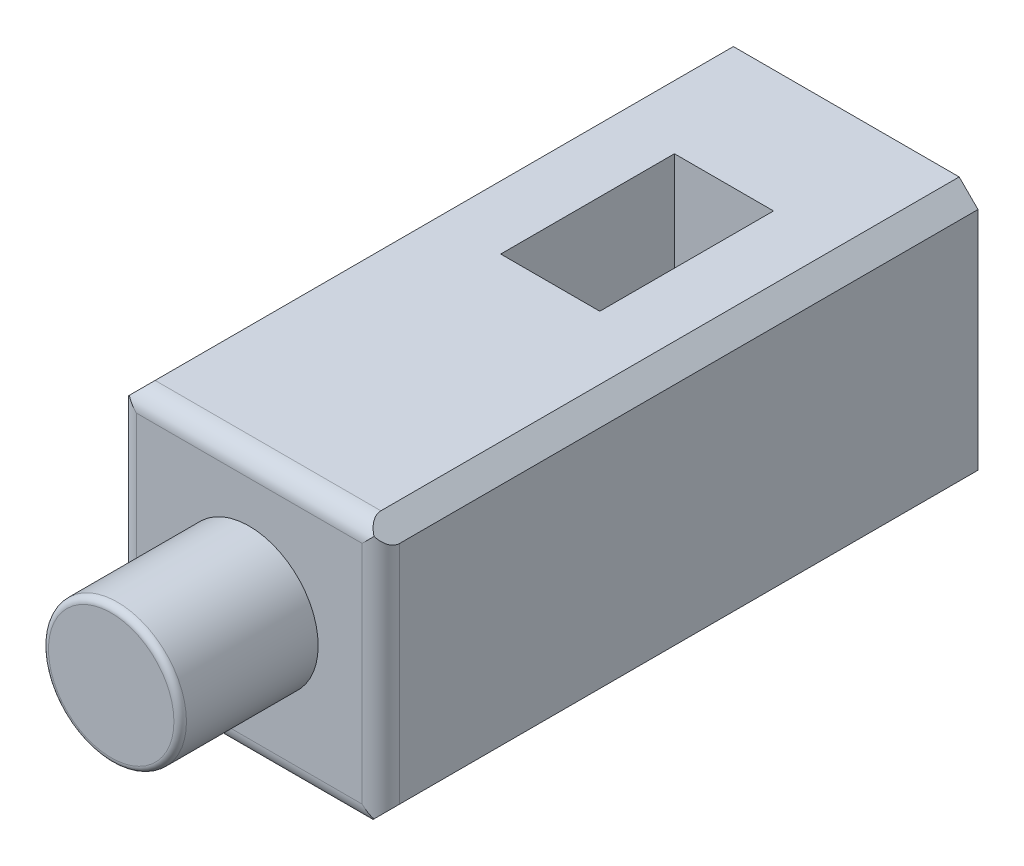
ISO-10303-21;
HEADER;
FILE_DESCRIPTION(('STEP AP214'),'2;1');
FILE_NAME('part.step','',(''),(''),'','','');
FILE_SCHEMA(('AUTOMOTIVE_DESIGN { 1 0 10303 214 1 1 1 1 }'));
ENDSEC;
DATA;
#1=APPLICATION_CONTEXT('core data for automotive mechanical design processes');
#2=APPLICATION_PROTOCOL_DEFINITION('international standard','automotive_design',2000,#1);
#3=PRODUCT_CONTEXT('',#1,'mechanical');
#4=PRODUCT('Part','Part','',(#3));
#5=PRODUCT_RELATED_PRODUCT_CATEGORY('part','',(#4));
#6=PRODUCT_DEFINITION_FORMATION('','',#4);
#7=PRODUCT_DEFINITION_CONTEXT('part definition',#1,'design');
#8=PRODUCT_DEFINITION('design','',#6,#7);
#9=PRODUCT_DEFINITION_SHAPE('','',#8);
#10=(LENGTH_UNIT() NAMED_UNIT(*) SI_UNIT(.MILLI.,.METRE.));
#11=(NAMED_UNIT(*) PLANE_ANGLE_UNIT() SI_UNIT($,.RADIAN.));
#12=(NAMED_UNIT(*) SI_UNIT($,.STERADIAN.) SOLID_ANGLE_UNIT());
#13=UNCERTAINTY_MEASURE_WITH_UNIT(LENGTH_MEASURE(1.E-05),#10,'distance_accuracy_value','');
#14=(GEOMETRIC_REPRESENTATION_CONTEXT(3) GLOBAL_UNCERTAINTY_ASSIGNED_CONTEXT((#13)) GLOBAL_UNIT_ASSIGNED_CONTEXT((#10,
#11,#12)) REPRESENTATION_CONTEXT('',''));
#15=CARTESIAN_POINT('',(0.,0.,0.));
#16=DIRECTION('',(0.,0.,1.));
#17=DIRECTION('',(1.,0.,0.));
#18=AXIS2_PLACEMENT_3D('',#15,#16,#17);
#19=CARTESIAN_POINT('',(21.,-21.,95.2));
#20=DIRECTION('',(-1.,0.,0.));
#21=DIRECTION('',(0.,0.,1.));
#22=AXIS2_PLACEMENT_3D('',#19,#20,#21);
#23=PLANE('',#22);
#24=DIRECTION('',(0.,0.,1.));
#25=VECTOR('',#24,1.);
#26=CARTESIAN_POINT('',(21.,18.,95.2));
#27=LINE('',#26,#25);
#28=CARTESIAN_POINT('',(21.,18.,0.));
#29=VERTEX_POINT('',#28);
#30=CARTESIAN_POINT('',(21.,18.,92.2));
#31=VERTEX_POINT('',#30);
#32=EDGE_CURVE('E233',#29,#31,#27,.T.);
#33=ORIENTED_EDGE('',*,*,#32,.T.);
#34=DIRECTION('',(0.,1.,0.));
#35=VECTOR('',#34,1.);
#36=CARTESIAN_POINT('',(21.,-21.,92.2));
#37=LINE('',#36,#35);
#38=CARTESIAN_POINT('',(21.,-18.,92.2));
#39=VERTEX_POINT('',#38);
#40=EDGE_CURVE('E267',#31,#39,#37,.F.);
#41=ORIENTED_EDGE('',*,*,#40,.T.);
#42=DIRECTION('',(0.,0.,-1.));
#43=VECTOR('',#42,1.);
#44=CARTESIAN_POINT('',(21.,-18.,95.2));
#45=LINE('',#44,#43);
#46=CARTESIAN_POINT('',(21.,-18.,0.));
#47=VERTEX_POINT('',#46);
#48=EDGE_CURVE('E236',#39,#47,#45,.T.);
#49=ORIENTED_EDGE('',*,*,#48,.T.);
#50=DIRECTION('',(0.,1.,0.));
#51=VECTOR('',#50,1.);
#52=CARTESIAN_POINT('',(21.,-21.,0.));
#53=LINE('',#52,#51);
#54=EDGE_CURVE('E193',#47,#29,#53,.T.);
#55=ORIENTED_EDGE('',*,*,#54,.T.);
#56=EDGE_LOOP('',(#33,#41,#49,#55));
#57=FACE_BOUND('',#56,.T.);
#58=ADVANCED_FACE('F36',(#57),#23,.F.);
#59=CARTESIAN_POINT('',(-21.,21.,95.2));
#60=DIRECTION('',(0.,-1.,0.));
#61=DIRECTION('',(0.,0.,-1.));
#62=AXIS2_PLACEMENT_3D('',#59,#60,#61);
#63=PLANE('',#62);
#64=DIRECTION('',(-1.,0.,0.));
#65=VECTOR('',#64,1.);
#66=CARTESIAN_POINT('',(-7.9,21.,19.5));
#67=LINE('',#66,#65);
#68=CARTESIAN_POINT('',(7.9,21.,19.5));
#69=VERTEX_POINT('',#68);
#70=CARTESIAN_POINT('',(-7.9,21.,19.5));
#71=VERTEX_POINT('',#70);
#72=EDGE_CURVE('E186',#69,#71,#67,.T.);
#73=ORIENTED_EDGE('',*,*,#72,.F.);
#74=DIRECTION('',(0.,0.,-1.));
#75=VECTOR('',#74,1.);
#76=CARTESIAN_POINT('',(7.9,21.,47.2));
#77=LINE('',#76,#75);
#78=CARTESIAN_POINT('',(7.9,21.,47.2));
#79=VERTEX_POINT('',#78);
#80=EDGE_CURVE('E157',#79,#69,#77,.T.);
#81=ORIENTED_EDGE('',*,*,#80,.F.);
#82=DIRECTION('',(1.,0.,0.));
#83=VECTOR('',#82,1.);
#84=CARTESIAN_POINT('',(-7.9,21.,47.2));
#85=LINE('',#84,#83);
#86=CARTESIAN_POINT('',(-7.9,21.,47.2));
#87=VERTEX_POINT('',#86);
#88=EDGE_CURVE('E174',#87,#79,#85,.T.);
#89=ORIENTED_EDGE('',*,*,#88,.F.);
#90=DIRECTION('',(0.,0.,1.));
#91=VECTOR('',#90,1.);
#92=CARTESIAN_POINT('',(-7.9,21.,47.2));
#93=LINE('',#92,#91);
#94=EDGE_CURVE('E177',#71,#87,#93,.T.);
#95=ORIENTED_EDGE('',*,*,#94,.F.);
#96=EDGE_LOOP('',(#73,#81,#89,#95));
#97=FACE_BOUND('',#96,.T.);
#98=DIRECTION('',(0.,0.,1.));
#99=VECTOR('',#98,1.);
#100=CARTESIAN_POINT('',(-18.,21.,95.2));
#101=LINE('',#100,#99);
#102=CARTESIAN_POINT('',(-18.,21.,0.));
#103=VERTEX_POINT('',#102);
#104=CARTESIAN_POINT('',(-18.,21.,92.2));
#105=VERTEX_POINT('',#104);
#106=EDGE_CURVE('E231',#103,#105,#101,.T.);
#107=ORIENTED_EDGE('',*,*,#106,.T.);
#108=DIRECTION('',(-1.,0.,0.));
#109=VECTOR('',#108,1.);
#110=CARTESIAN_POINT('',(-21.,21.,92.2));
#111=LINE('',#110,#109);
#112=CARTESIAN_POINT('',(18.,21.,92.2));
#113=VERTEX_POINT('',#112);
#114=EDGE_CURVE('E59',#105,#113,#111,.F.);
#115=ORIENTED_EDGE('',*,*,#114,.T.);
#116=DIRECTION('',(0.,0.,-1.));
#117=VECTOR('',#116,1.);
#118=CARTESIAN_POINT('',(18.,21.,95.2));
#119=LINE('',#118,#117);
#120=CARTESIAN_POINT('',(18.,21.,0.));
#121=VERTEX_POINT('',#120);
#122=EDGE_CURVE('E229',#113,#121,#119,.T.);
#123=ORIENTED_EDGE('',*,*,#122,.T.);
#124=DIRECTION('',(-1.,0.,0.));
#125=VECTOR('',#124,1.);
#126=CARTESIAN_POINT('',(-21.,21.,0.));
#127=LINE('',#126,#125);
#128=EDGE_CURVE('E204',#121,#103,#127,.T.);
#129=ORIENTED_EDGE('',*,*,#128,.T.);
#130=EDGE_LOOP('',(#107,#115,#123,#129));
#131=FACE_BOUND('',#130,.T.);
#132=ADVANCED_FACE('F296',(#97,#131),#63,.F.);
#133=CARTESIAN_POINT('',(-21.,-21.,95.2));
#134=DIRECTION('',(1.,0.,0.));
#135=DIRECTION('',(0.,0.,-1.));
#136=AXIS2_PLACEMENT_3D('',#133,#134,#135);
#137=PLANE('',#136);
#138=DIRECTION('',(0.,0.,1.));
#139=VECTOR('',#138,1.);
#140=CARTESIAN_POINT('',(-21.,-18.,95.2));
#141=LINE('',#140,#139);
#142=CARTESIAN_POINT('',(-21.,-18.,0.));
#143=VERTEX_POINT('',#142);
#144=CARTESIAN_POINT('',(-21.,-18.,92.2));
#145=VERTEX_POINT('',#144);
#146=EDGE_CURVE('E226',#143,#145,#141,.T.);
#147=ORIENTED_EDGE('',*,*,#146,.T.);
#148=DIRECTION('',(0.,-1.,0.));
#149=VECTOR('',#148,1.);
#150=CARTESIAN_POINT('',(-21.,-21.,92.2));
#151=LINE('',#150,#149);
#152=CARTESIAN_POINT('',(-21.,18.,92.2));
#153=VERTEX_POINT('',#152);
#154=EDGE_CURVE('E251',#145,#153,#151,.F.);
#155=ORIENTED_EDGE('',*,*,#154,.T.);
#156=DIRECTION('',(0.,0.,-1.));
#157=VECTOR('',#156,1.);
#158=CARTESIAN_POINT('',(-21.,18.,95.2));
#159=LINE('',#158,#157);
#160=CARTESIAN_POINT('',(-21.,18.,0.));
#161=VERTEX_POINT('',#160);
#162=EDGE_CURVE('E224',#153,#161,#159,.T.);
#163=ORIENTED_EDGE('',*,*,#162,.T.);
#164=DIRECTION('',(0.,-1.,0.));
#165=VECTOR('',#164,1.);
#166=CARTESIAN_POINT('',(-21.,-21.,0.));
#167=LINE('',#166,#165);
#168=EDGE_CURVE('E207',#161,#143,#167,.T.);
#169=ORIENTED_EDGE('',*,*,#168,.T.);
#170=EDGE_LOOP('',(#147,#155,#163,#169));
#171=FACE_BOUND('',#170,.T.);
#172=ADVANCED_FACE('F302',(#171),#137,.F.);
#173=CARTESIAN_POINT('',(-21.,-21.,95.2));
#174=DIRECTION('',(0.,1.,0.));
#175=DIRECTION('',(0.,0.,1.));
#176=AXIS2_PLACEMENT_3D('',#173,#174,#175);
#177=PLANE('',#176);
#178=DIRECTION('',(0.,0.,1.));
#179=VECTOR('',#178,1.);
#180=CARTESIAN_POINT('',(18.,-21.,95.2));
#181=LINE('',#180,#179);
#182=CARTESIAN_POINT('',(18.,-21.,0.));
#183=VERTEX_POINT('',#182);
#184=CARTESIAN_POINT('',(18.,-21.,92.2));
#185=VERTEX_POINT('',#184);
#186=EDGE_CURVE('E200',#183,#185,#181,.T.);
#187=ORIENTED_EDGE('',*,*,#186,.T.);
#188=DIRECTION('',(1.,0.,0.));
#189=VECTOR('',#188,1.);
#190=CARTESIAN_POINT('',(-21.,-21.,92.2));
#191=LINE('',#190,#189);
#192=CARTESIAN_POINT('',(-18.,-21.,92.2));
#193=VERTEX_POINT('',#192);
#194=EDGE_CURVE('E262',#185,#193,#191,.F.);
#195=ORIENTED_EDGE('',*,*,#194,.T.);
#196=DIRECTION('',(0.,0.,-1.));
#197=VECTOR('',#196,1.);
#198=CARTESIAN_POINT('',(-18.,-21.,95.2));
#199=LINE('',#198,#197);
#200=CARTESIAN_POINT('',(-18.,-21.,0.));
#201=VERTEX_POINT('',#200);
#202=EDGE_CURVE('E214',#193,#201,#199,.T.);
#203=ORIENTED_EDGE('',*,*,#202,.T.);
#204=DIRECTION('',(1.,0.,0.));
#205=VECTOR('',#204,1.);
#206=CARTESIAN_POINT('',(-21.,-21.,0.));
#207=LINE('',#206,#205);
#208=EDGE_CURVE('E201',#201,#183,#207,.T.);
#209=ORIENTED_EDGE('',*,*,#208,.T.);
#210=EDGE_LOOP('',(#187,#195,#203,#209));
#211=FACE_BOUND('',#210,.T.);
#212=ADVANCED_FACE('F380',(#211),#177,.F.);
#213=CARTESIAN_POINT('',(0.,0.,95.2));
#214=DIRECTION('',(0.,0.,-1.));
#215=DIRECTION('',(-1.,0.,0.));
#216=AXIS2_PLACEMENT_3D('',#213,#214,#215);
#217=PLANE('',#216);
#218=DIRECTION('',(-1.,0.,0.));
#219=VECTOR('',#218,1.);
#220=CARTESIAN_POINT('',(0.,18.,95.2));
#221=LINE('',#220,#219);
#222=CARTESIAN_POINT('',(18.,18.,95.2));
#223=VERTEX_POINT('',#222);
#224=CARTESIAN_POINT('',(-18.,18.,95.2));
#225=VERTEX_POINT('',#224);
#226=EDGE_CURVE('E238',#223,#225,#221,.T.);
#227=ORIENTED_EDGE('',*,*,#226,.T.);
#228=DIRECTION('',(0.,-1.,0.));
#229=VECTOR('',#228,1.);
#230=CARTESIAN_POINT('',(-18.,0.,95.2));
#231=LINE('',#230,#229);
#232=CARTESIAN_POINT('',(-18.,-18.,95.2));
#233=VERTEX_POINT('',#232);
#234=EDGE_CURVE('E244',#225,#233,#231,.T.);
#235=ORIENTED_EDGE('',*,*,#234,.T.);
#236=DIRECTION('',(1.,0.,0.));
#237=VECTOR('',#236,1.);
#238=CARTESIAN_POINT('',(0.,-18.,95.2));
#239=LINE('',#238,#237);
#240=CARTESIAN_POINT('',(18.,-18.,95.2));
#241=VERTEX_POINT('',#240);
#242=EDGE_CURVE('E242',#233,#241,#239,.T.);
#243=ORIENTED_EDGE('',*,*,#242,.T.);
#244=DIRECTION('',(0.,1.,0.));
#245=VECTOR('',#244,1.);
#246=CARTESIAN_POINT('',(18.,0.,95.2));
#247=LINE('',#246,#245);
#248=EDGE_CURVE('E240',#241,#223,#247,.T.);
#249=ORIENTED_EDGE('',*,*,#248,.T.);
#250=EDGE_LOOP('',(#227,#235,#243,#249));
#251=FACE_BOUND('',#250,.T.);
#252=CARTESIAN_POINT('',(0.,0.393132524079327,95.2));
#253=DIRECTION('',(0.,0.,1.));
#254=DIRECTION('',(1.,0.,0.));
#255=AXIS2_PLACEMENT_3D('',#252,#253,#254);
#256=CIRCLE('',#255,11.);
#257=CARTESIAN_POINT('',(11.,0.393132524079327,95.2));
#258=VERTEX_POINT('',#257);
#259=EDGE_CURVE('E197',#258,#258,#256,.T.);
#260=ORIENTED_EDGE('',*,*,#259,.F.);
#261=EDGE_LOOP('',(#260));
#262=FACE_BOUND('',#261,.T.);
#263=ADVANCED_FACE('F373',(#251,#262),#217,.F.);
#264=CARTESIAN_POINT('',(0.,0.,0.));
#265=DIRECTION('',(0.,0.,-1.));
#266=DIRECTION('',(-1.,0.,0.));
#267=AXIS2_PLACEMENT_3D('',#264,#265,#266);
#268=PLANE('',#267);
#269=CARTESIAN_POINT('',(0.,0.,0.));
#270=DIRECTION('',(0.,0.,-1.));
#271=DIRECTION('',(-1.,0.,0.));
#272=AXIS2_PLACEMENT_3D('',#269,#270,#271);
#273=CIRCLE('',#272,5.);
#274=CARTESIAN_POINT('',(-5.,0.,0.));
#275=VERTEX_POINT('',#274);
#276=EDGE_CURVE('E180',#275,#275,#273,.T.);
#277=ORIENTED_EDGE('',*,*,#276,.F.);
#278=EDGE_LOOP('',(#277));
#279=FACE_BOUND('',#278,.T.);
#280=ORIENTED_EDGE('',*,*,#208,.F.);
#281=DIRECTION('',(0.707106781186546,-0.707106781186549,0.));
#282=VECTOR('',#281,1.);
#283=CARTESIAN_POINT('',(-19.5,-19.5,0.));
#284=LINE('',#283,#282);
#285=EDGE_CURVE('E222',#201,#143,#284,.F.);
#286=ORIENTED_EDGE('',*,*,#285,.T.);
#287=ORIENTED_EDGE('',*,*,#168,.F.);
#288=DIRECTION('',(-0.707106781186548,-0.707106781186547,0.));
#289=VECTOR('',#288,1.);
#290=CARTESIAN_POINT('',(-19.5,19.5,0.));
#291=LINE('',#290,#289);
#292=EDGE_CURVE('E220',#161,#103,#291,.F.);
#293=ORIENTED_EDGE('',*,*,#292,.T.);
#294=ORIENTED_EDGE('',*,*,#128,.F.);
#295=DIRECTION('',(-0.707106781186546,0.707106781186549,0.));
#296=VECTOR('',#295,1.);
#297=CARTESIAN_POINT('',(19.5,19.4999999999999,0.));
#298=LINE('',#297,#296);
#299=EDGE_CURVE('E216',#121,#29,#298,.F.);
#300=ORIENTED_EDGE('',*,*,#299,.T.);
#301=ORIENTED_EDGE('',*,*,#54,.F.);
#302=DIRECTION('',(0.70710678118655,0.707106781186545,0.));
#303=VECTOR('',#302,1.);
#304=CARTESIAN_POINT('',(19.4999999999999,-19.5000000000001,0.));
#305=LINE('',#304,#303);
#306=EDGE_CURVE('E218',#47,#183,#305,.F.);
#307=ORIENTED_EDGE('',*,*,#306,.T.);
#308=EDGE_LOOP('',(#280,#286,#287,#293,#294,#300,#301,#307));
#309=FACE_BOUND('',#308,.T.);
#310=ADVANCED_FACE('F357',(#279,#309),#268,.T.);
#311=CARTESIAN_POINT('',(0.,0.393132524079327,117.2));
#312=DIRECTION('',(0.,0.,-1.));
#313=DIRECTION('',(-1.,0.,0.));
#314=AXIS2_PLACEMENT_3D('',#311,#312,#313);
#315=CYLINDRICAL_SURFACE('',#314,11.);
#316=CARTESIAN_POINT('',(0.,0.393132524079327,116.2));
#317=DIRECTION('',(0.,0.,1.));
#318=DIRECTION('',(1.,0.,0.));
#319=AXIS2_PLACEMENT_3D('',#316,#317,#318);
#320=CIRCLE('',#319,11.);
#321=CARTESIAN_POINT('',(11.,0.393132524079327,116.2));
#322=VERTEX_POINT('',#321);
#323=EDGE_CURVE('E11',#322,#322,#320,.F.);
#324=ORIENTED_EDGE('',*,*,#323,.T.);
#325=EDGE_LOOP('',(#324));
#326=FACE_BOUND('',#325,.T.);
#327=ORIENTED_EDGE('',*,*,#259,.T.);
#328=EDGE_LOOP('',(#327));
#329=FACE_BOUND('',#328,.T.);
#330=ADVANCED_FACE('F393',(#326,#329),#315,.T.);
#331=CARTESIAN_POINT('',(0.,0.393132524079327,117.2));
#332=DIRECTION('',(0.,0.,1.));
#333=DIRECTION('',(1.,0.,0.));
#334=AXIS2_PLACEMENT_3D('',#331,#332,#333);
#335=PLANE('',#334);
#336=CARTESIAN_POINT('',(0.,0.393132524079327,117.2));
#337=DIRECTION('',(0.,0.,1.));
#338=DIRECTION('',(1.,0.,0.));
#339=AXIS2_PLACEMENT_3D('',#336,#337,#338);
#340=CIRCLE('',#339,10.);
#341=CARTESIAN_POINT('',(10.,0.393132524079327,117.2));
#342=VERTEX_POINT('',#341);
#343=EDGE_CURVE('E44',#342,#342,#340,.T.);
#344=ORIENTED_EDGE('',*,*,#343,.T.);
#345=EDGE_LOOP('',(#344));
#346=FACE_BOUND('',#345,.T.);
#347=ADVANCED_FACE('F283',(#346),#335,.T.);
#348=CARTESIAN_POINT('',(7.9,0.,47.2));
#349=DIRECTION('',(1.,0.,0.));
#350=DIRECTION('',(0.,0.,-1.));
#351=AXIS2_PLACEMENT_3D('',#348,#349,#350);
#352=PLANE('',#351);
#353=ORIENTED_EDGE('',*,*,#80,.T.);
#354=DIRECTION('',(0.,1.,0.));
#355=VECTOR('',#354,1.);
#356=CARTESIAN_POINT('',(7.9,0.,19.5));
#357=LINE('',#356,#355);
#358=CARTESIAN_POINT('',(7.9,0.,19.5));
#359=VERTEX_POINT('',#358);
#360=EDGE_CURVE('E150',#359,#69,#357,.T.);
#361=ORIENTED_EDGE('',*,*,#360,.F.);
#362=DIRECTION('',(0.,0.,-1.));
#363=VECTOR('',#362,1.);
#364=CARTESIAN_POINT('',(7.9,0.,47.2));
#365=LINE('',#364,#363);
#366=CARTESIAN_POINT('',(7.9,0.,47.2));
#367=VERTEX_POINT('',#366);
#368=EDGE_CURVE('E154',#367,#359,#365,.T.);
#369=ORIENTED_EDGE('',*,*,#368,.F.);
#370=DIRECTION('',(0.,1.,0.));
#371=VECTOR('',#370,1.);
#372=CARTESIAN_POINT('',(7.9,0.,47.2));
#373=LINE('',#372,#371);
#374=EDGE_CURVE('E191',#367,#79,#373,.T.);
#375=ORIENTED_EDGE('',*,*,#374,.T.);
#376=EDGE_LOOP('',(#353,#361,#369,#375));
#377=FACE_BOUND('',#376,.T.);
#378=ADVANCED_FACE('F152',(#377),#352,.F.);
#379=CARTESIAN_POINT('',(-7.9,0.,47.2));
#380=DIRECTION('',(0.,0.,1.));
#381=DIRECTION('',(1.,0.,0.));
#382=AXIS2_PLACEMENT_3D('',#379,#380,#381);
#383=PLANE('',#382);
#384=ORIENTED_EDGE('',*,*,#88,.T.);
#385=ORIENTED_EDGE('',*,*,#374,.F.);
#386=DIRECTION('',(1.,0.,0.));
#387=VECTOR('',#386,1.);
#388=CARTESIAN_POINT('',(-7.9,0.,47.2));
#389=LINE('',#388,#387);
#390=CARTESIAN_POINT('',(-7.9,0.,47.2));
#391=VERTEX_POINT('',#390);
#392=EDGE_CURVE('E162',#391,#367,#389,.T.);
#393=ORIENTED_EDGE('',*,*,#392,.F.);
#394=DIRECTION('',(0.,1.,0.));
#395=VECTOR('',#394,1.);
#396=CARTESIAN_POINT('',(-7.9,0.,47.2));
#397=LINE('',#396,#395);
#398=EDGE_CURVE('E194',#391,#87,#397,.T.);
#399=ORIENTED_EDGE('',*,*,#398,.T.);
#400=EDGE_LOOP('',(#384,#385,#393,#399));
#401=FACE_BOUND('',#400,.T.);
#402=ADVANCED_FACE('F404',(#401),#383,.F.);
#403=CARTESIAN_POINT('',(-7.9,0.,47.2));
#404=DIRECTION('',(-1.,0.,0.));
#405=DIRECTION('',(0.,0.,1.));
#406=AXIS2_PLACEMENT_3D('',#403,#404,#405);
#407=PLANE('',#406);
#408=ORIENTED_EDGE('',*,*,#94,.T.);
#409=ORIENTED_EDGE('',*,*,#398,.F.);
#410=DIRECTION('',(0.,0.,1.));
#411=VECTOR('',#410,1.);
#412=CARTESIAN_POINT('',(-7.9,0.,47.2));
#413=LINE('',#412,#411);
#414=CARTESIAN_POINT('',(-7.9,0.,19.5));
#415=VERTEX_POINT('',#414);
#416=EDGE_CURVE('E170',#415,#391,#413,.T.);
#417=ORIENTED_EDGE('',*,*,#416,.F.);
#418=DIRECTION('',(0.,1.,0.));
#419=VECTOR('',#418,1.);
#420=CARTESIAN_POINT('',(-7.9,0.,19.5));
#421=LINE('',#420,#419);
#422=EDGE_CURVE('E161',#415,#71,#421,.T.);
#423=ORIENTED_EDGE('',*,*,#422,.T.);
#424=EDGE_LOOP('',(#408,#409,#417,#423));
#425=FACE_BOUND('',#424,.T.);
#426=ADVANCED_FACE('F407',(#425),#407,.F.);
#427=CARTESIAN_POINT('',(-7.9,0.,19.5));
#428=DIRECTION('',(0.,0.,-1.));
#429=DIRECTION('',(-1.,0.,0.));
#430=AXIS2_PLACEMENT_3D('',#427,#428,#429);
#431=PLANE('',#430);
#432=ORIENTED_EDGE('',*,*,#72,.T.);
#433=ORIENTED_EDGE('',*,*,#422,.F.);
#434=DIRECTION('',(-1.,0.,0.));
#435=VECTOR('',#434,1.);
#436=CARTESIAN_POINT('',(-7.9,0.,19.5));
#437=LINE('',#436,#435);
#438=EDGE_CURVE('E165',#359,#415,#437,.T.);
#439=ORIENTED_EDGE('',*,*,#438,.F.);
#440=ORIENTED_EDGE('',*,*,#360,.T.);
#441=EDGE_LOOP('',(#432,#433,#439,#440));
#442=FACE_BOUND('',#441,.T.);
#443=ADVANCED_FACE('F166',(#442),#431,.F.);
#444=CARTESIAN_POINT('',(0.,0.,0.));
#445=DIRECTION('',(0.,-1.,0.));
#446=DIRECTION('',(0.,0.,-1.));
#447=AXIS2_PLACEMENT_3D('',#444,#445,#446);
#448=PLANE('',#447);
#449=ORIENTED_EDGE('',*,*,#368,.T.);
#450=ORIENTED_EDGE('',*,*,#438,.T.);
#451=ORIENTED_EDGE('',*,*,#416,.T.);
#452=ORIENTED_EDGE('',*,*,#392,.T.);
#453=EDGE_LOOP('',(#449,#450,#451,#452));
#454=FACE_BOUND('',#453,.T.);
#455=ADVANCED_FACE('F172',(#454),#448,.F.);
#456=CARTESIAN_POINT('',(0.,0.,10.));
#457=DIRECTION('',(0.,0.,-1.));
#458=DIRECTION('',(-1.,0.,0.));
#459=AXIS2_PLACEMENT_3D('',#456,#457,#458);
#460=CYLINDRICAL_SURFACE('',#459,5.);
#461=CARTESIAN_POINT('',(0.,0.,10.));
#462=DIRECTION('',(0.,0.,-1.));
#463=DIRECTION('',(-1.,0.,0.));
#464=AXIS2_PLACEMENT_3D('',#461,#462,#463);
#465=CIRCLE('',#464,5.);
#466=CARTESIAN_POINT('',(-5.,0.,10.));
#467=VERTEX_POINT('',#466);
#468=EDGE_CURVE('E187',#467,#467,#465,.T.);
#469=ORIENTED_EDGE('',*,*,#468,.F.);
#470=EDGE_LOOP('',(#469));
#471=FACE_BOUND('',#470,.T.);
#472=ORIENTED_EDGE('',*,*,#276,.T.);
#473=EDGE_LOOP('',(#472));
#474=FACE_BOUND('',#473,.T.);
#475=ADVANCED_FACE('F416',(#471,#474),#460,.F.);
#476=CARTESIAN_POINT('',(0.,0.,10.));
#477=DIRECTION('',(0.,0.,-1.));
#478=DIRECTION('',(-1.,0.,0.));
#479=AXIS2_PLACEMENT_3D('',#476,#477,#478);
#480=PLANE('',#479);
#481=ORIENTED_EDGE('',*,*,#468,.T.);
#482=EDGE_LOOP('',(#481));
#483=FACE_BOUND('',#482,.T.);
#484=ADVANCED_FACE('F315',(#483),#480,.T.);
#485=CARTESIAN_POINT('',(-18.,-21.,95.2));
#486=DIRECTION('',(0.707106781186549,0.707106781186546,0.));
#487=DIRECTION('',(0.,0.,-1.));
#488=AXIS2_PLACEMENT_3D('',#485,#486,#487);
#489=PLANE('',#488);
#490=CARTESIAN_POINT('',(-21.,-18.,92.2));
#491=DIRECTION('',(0.707106781186549,0.707106781186546,0.));
#492=DIRECTION('',(0.707106781186546,-0.707106781186549,0.));
#493=AXIS2_PLACEMENT_3D('',#490,#491,#492);
#494=ELLIPSE('',#493,4.24264068711928,3.);
#495=CARTESIAN_POINT('',(-19.5,-19.5,94.7980762113533));
#496=VERTEX_POINT('',#495);
#497=EDGE_CURVE('E247',#193,#496,#494,.F.);
#498=ORIENTED_EDGE('',*,*,#497,.T.);
#499=CARTESIAN_POINT('',(-18.,-21.,92.2));
#500=DIRECTION('',(0.707106781186549,0.707106781186546,0.));
#501=DIRECTION('',(0.707106781186546,-0.707106781186549,0.));
#502=AXIS2_PLACEMENT_3D('',#499,#500,#501);
#503=ELLIPSE('',#502,4.2426406871193,3.);
#504=EDGE_CURVE('E249',#496,#145,#503,.F.);
#505=ORIENTED_EDGE('',*,*,#504,.T.);
#506=ORIENTED_EDGE('',*,*,#146,.F.);
#507=ORIENTED_EDGE('',*,*,#285,.F.);
#508=ORIENTED_EDGE('',*,*,#202,.F.);
#509=EDGE_LOOP('',(#498,#505,#506,#507,#508));
#510=FACE_BOUND('',#509,.T.);
#511=ADVANCED_FACE('F308',(#510),#489,.F.);
#512=CARTESIAN_POINT('',(-21.,18.,95.2));
#513=DIRECTION('',(0.707106781186547,-0.707106781186548,0.));
#514=DIRECTION('',(0.,0.,-1.));
#515=AXIS2_PLACEMENT_3D('',#512,#513,#514);
#516=PLANE('',#515);
#517=ORIENTED_EDGE('',*,*,#162,.F.);
#518=CARTESIAN_POINT('',(-18.,21.,92.2));
#519=DIRECTION('',(0.707106781186547,-0.707106781186548,0.));
#520=DIRECTION('',(-0.707106781186548,-0.707106781186547,0.));
#521=AXIS2_PLACEMENT_3D('',#518,#519,#520);
#522=ELLIPSE('',#521,4.24264068711928,3.);
#523=CARTESIAN_POINT('',(-19.5,19.5,94.7980762113533));
#524=VERTEX_POINT('',#523);
#525=EDGE_CURVE('E256',#153,#524,#522,.F.);
#526=ORIENTED_EDGE('',*,*,#525,.T.);
#527=CARTESIAN_POINT('',(-21.,18.,92.2));
#528=DIRECTION('',(0.707106781186547,-0.707106781186548,0.));
#529=DIRECTION('',(-0.707106781186548,-0.707106781186547,0.));
#530=AXIS2_PLACEMENT_3D('',#527,#528,#529);
#531=ELLIPSE('',#530,4.24264068711929,3.);
#532=EDGE_CURVE('E254',#524,#105,#531,.F.);
#533=ORIENTED_EDGE('',*,*,#532,.T.);
#534=ORIENTED_EDGE('',*,*,#106,.F.);
#535=ORIENTED_EDGE('',*,*,#292,.F.);
#536=EDGE_LOOP('',(#517,#526,#533,#534,#535));
#537=FACE_BOUND('',#536,.T.);
#538=ADVANCED_FACE('F314',(#537),#516,.F.);
#539=CARTESIAN_POINT('',(21.,-18.,95.2));
#540=DIRECTION('',(-0.707106781186545,0.70710678118655,0.));
#541=DIRECTION('',(0.,0.,-1.));
#542=AXIS2_PLACEMENT_3D('',#539,#540,#541);
#543=PLANE('',#542);
#544=CARTESIAN_POINT('',(18.,-21.,92.2));
#545=DIRECTION('',(-0.707106781186545,0.70710678118655,0.));
#546=DIRECTION('',(0.70710678118655,0.707106781186545,0.));
#547=AXIS2_PLACEMENT_3D('',#544,#545,#546);
#548=ELLIPSE('',#547,4.24264068711927,3.);
#549=CARTESIAN_POINT('',(19.5,-19.5,94.7980762113533));
#550=VERTEX_POINT('',#549);
#551=EDGE_CURVE('E258',#39,#550,#548,.F.);
#552=ORIENTED_EDGE('',*,*,#551,.T.);
#553=CARTESIAN_POINT('',(21.,-18.,92.2));
#554=DIRECTION('',(-0.707106781186545,0.70710678118655,0.));
#555=DIRECTION('',(0.70710678118655,0.707106781186545,0.));
#556=AXIS2_PLACEMENT_3D('',#553,#554,#555);
#557=ELLIPSE('',#556,4.2426406871193,3.);
#558=EDGE_CURVE('E260',#550,#185,#557,.F.);
#559=ORIENTED_EDGE('',*,*,#558,.T.);
#560=ORIENTED_EDGE('',*,*,#186,.F.);
#561=ORIENTED_EDGE('',*,*,#306,.F.);
#562=ORIENTED_EDGE('',*,*,#48,.F.);
#563=EDGE_LOOP('',(#552,#559,#560,#561,#562));
#564=FACE_BOUND('',#563,.T.);
#565=ADVANCED_FACE('F322',(#564),#543,.F.);
#566=CARTESIAN_POINT('',(18.,21.,95.2));
#567=DIRECTION('',(-0.707106781186549,-0.707106781186546,0.));
#568=DIRECTION('',(0.,0.,-1.));
#569=AXIS2_PLACEMENT_3D('',#566,#567,#568);
#570=PLANE('',#569);
#571=CARTESIAN_POINT('',(21.,18.,92.2));
#572=DIRECTION('',(-0.707106781186549,-0.707106781186546,0.));
#573=DIRECTION('',(-0.707106781186546,0.707106781186549,0.));
#574=AXIS2_PLACEMENT_3D('',#571,#572,#573);
#575=ELLIPSE('',#574,4.24264068711928,3.);
#576=CARTESIAN_POINT('',(19.5,19.5,94.7980762113533));
#577=VERTEX_POINT('',#576);
#578=EDGE_CURVE('E51',#113,#577,#575,.F.);
#579=ORIENTED_EDGE('',*,*,#578,.T.);
#580=CARTESIAN_POINT('',(18.,21.,92.2));
#581=DIRECTION('',(-0.707106781186549,-0.707106781186546,0.));
#582=DIRECTION('',(-0.707106781186546,0.707106781186549,0.));
#583=AXIS2_PLACEMENT_3D('',#580,#581,#582);
#584=ELLIPSE('',#583,4.2426406871193,3.);
#585=EDGE_CURVE('E265',#577,#31,#584,.F.);
#586=ORIENTED_EDGE('',*,*,#585,.T.);
#587=ORIENTED_EDGE('',*,*,#32,.F.);
#588=ORIENTED_EDGE('',*,*,#299,.F.);
#589=ORIENTED_EDGE('',*,*,#122,.F.);
#590=EDGE_LOOP('',(#579,#586,#587,#588,#589));
#591=FACE_BOUND('',#590,.T.);
#592=ADVANCED_FACE('F329',(#591),#570,.F.);
#593=CARTESIAN_POINT('',(18.,0.,92.2));
#594=DIRECTION('',(0.,1.,0.));
#595=DIRECTION('',(0.,0.,1.));
#596=AXIS2_PLACEMENT_3D('',#593,#594,#595);
#597=CYLINDRICAL_SURFACE('',#596,3.);
#598=ORIENTED_EDGE('',*,*,#40,.F.);
#599=ORIENTED_EDGE('',*,*,#585,.F.);
#600=CARTESIAN_POINT('',(18.,18.,92.2));
#601=DIRECTION('',(-0.707106781186547,0.707106781186547,0.));
#602=DIRECTION('',(-0.707106781186547,-0.707106781186547,0.));
#603=AXIS2_PLACEMENT_3D('',#600,#601,#602);
#604=ELLIPSE('',#603,4.24264068711928,3.);
#605=EDGE_CURVE('E278',#223,#577,#604,.T.);
#606=ORIENTED_EDGE('',*,*,#605,.F.);
#607=ORIENTED_EDGE('',*,*,#248,.F.);
#608=CARTESIAN_POINT('',(18.,-18.,92.2));
#609=DIRECTION('',(0.707106781186547,0.707106781186547,0.));
#610=DIRECTION('',(-0.707106781186547,0.707106781186547,0.));
#611=AXIS2_PLACEMENT_3D('',#608,#609,#610);
#612=ELLIPSE('',#611,4.24264068711928,3.);
#613=EDGE_CURVE('E275',#550,#241,#612,.F.);
#614=ORIENTED_EDGE('',*,*,#613,.F.);
#615=ORIENTED_EDGE('',*,*,#551,.F.);
#616=EDGE_LOOP('',(#598,#599,#606,#607,#614,#615));
#617=FACE_BOUND('',#616,.T.);
#618=ADVANCED_FACE('F334',(#617),#597,.T.);
#619=CARTESIAN_POINT('',(0.,18.,92.2));
#620=DIRECTION('',(-1.,0.,0.));
#621=DIRECTION('',(0.,0.,1.));
#622=AXIS2_PLACEMENT_3D('',#619,#620,#621);
#623=CYLINDRICAL_SURFACE('',#622,3.);
#624=ORIENTED_EDGE('',*,*,#114,.F.);
#625=ORIENTED_EDGE('',*,*,#532,.F.);
#626=CARTESIAN_POINT('',(-18.,18.,92.2));
#627=DIRECTION('',(-0.707106781186547,-0.707106781186547,0.));
#628=DIRECTION('',(0.707106781186547,-0.707106781186547,0.));
#629=AXIS2_PLACEMENT_3D('',#626,#627,#628);
#630=ELLIPSE('',#629,4.24264068711928,3.);
#631=EDGE_CURVE('E272',#225,#524,#630,.T.);
#632=ORIENTED_EDGE('',*,*,#631,.F.);
#633=ORIENTED_EDGE('',*,*,#226,.F.);
#634=ORIENTED_EDGE('',*,*,#605,.T.);
#635=ORIENTED_EDGE('',*,*,#578,.F.);
#636=EDGE_LOOP('',(#624,#625,#632,#633,#634,#635));
#637=FACE_BOUND('',#636,.T.);
#638=ADVANCED_FACE('F338',(#637),#623,.T.);
#639=CARTESIAN_POINT('',(0.,-18.,92.2));
#640=DIRECTION('',(1.,0.,0.));
#641=DIRECTION('',(0.,0.,-1.));
#642=AXIS2_PLACEMENT_3D('',#639,#640,#641);
#643=CYLINDRICAL_SURFACE('',#642,3.);
#644=ORIENTED_EDGE('',*,*,#613,.T.);
#645=ORIENTED_EDGE('',*,*,#242,.F.);
#646=CARTESIAN_POINT('',(-18.,-18.,92.2));
#647=DIRECTION('',(0.707106781186547,-0.707106781186547,0.));
#648=DIRECTION('',(0.707106781186547,0.707106781186547,0.));
#649=AXIS2_PLACEMENT_3D('',#646,#647,#648);
#650=ELLIPSE('',#649,4.24264068711928,3.);
#651=EDGE_CURVE('E270',#496,#233,#650,.F.);
#652=ORIENTED_EDGE('',*,*,#651,.F.);
#653=ORIENTED_EDGE('',*,*,#497,.F.);
#654=ORIENTED_EDGE('',*,*,#194,.F.);
#655=ORIENTED_EDGE('',*,*,#558,.F.);
#656=EDGE_LOOP('',(#644,#645,#652,#653,#654,#655));
#657=FACE_BOUND('',#656,.T.);
#658=ADVANCED_FACE('F291',(#657),#643,.T.);
#659=CARTESIAN_POINT('',(-18.,0.,92.2));
#660=DIRECTION('',(0.,-1.,0.));
#661=DIRECTION('',(0.,0.,-1.));
#662=AXIS2_PLACEMENT_3D('',#659,#660,#661);
#663=CYLINDRICAL_SURFACE('',#662,3.);
#664=ORIENTED_EDGE('',*,*,#525,.F.);
#665=ORIENTED_EDGE('',*,*,#154,.F.);
#666=ORIENTED_EDGE('',*,*,#504,.F.);
#667=ORIENTED_EDGE('',*,*,#651,.T.);
#668=ORIENTED_EDGE('',*,*,#234,.F.);
#669=ORIENTED_EDGE('',*,*,#631,.T.);
#670=EDGE_LOOP('',(#664,#665,#666,#667,#668,#669));
#671=FACE_BOUND('',#670,.T.);
#672=ADVANCED_FACE('F286',(#671),#663,.T.);
#673=CARTESIAN_POINT('',(0.,0.393132524079327,116.2));
#674=DIRECTION('',(0.,0.,1.));
#675=DIRECTION('',(1.,0.,0.));
#676=AXIS2_PLACEMENT_3D('',#673,#674,#675);
#677=TOROIDAL_SURFACE('',#676,10.,1.);
#678=ORIENTED_EDGE('',*,*,#323,.F.);
#679=EDGE_LOOP('',(#678));
#680=FACE_BOUND('',#679,.T.);
#681=ORIENTED_EDGE('',*,*,#343,.F.);
#682=EDGE_LOOP('',(#681));
#683=FACE_BOUND('',#682,.T.);
#684=ADVANCED_FACE('F38',(#680,#683),#677,.T.);
#685=CLOSED_SHELL('',(#58,#132,#172,#212,#263,#310,#330,#347,#378,#402,#426,#443,#455,#475,#484,
#511,#538,#565,#592,#618,#638,#658,#672,#684));
#686=MANIFOLD_SOLID_BREP('B2',#685);
#687=ADVANCED_BREP_SHAPE_REPRESENTATION('',(#18,#686),#14);
#688=SHAPE_DEFINITION_REPRESENTATION(#9,#687);
ENDSEC;
END-ISO-10303-21;
